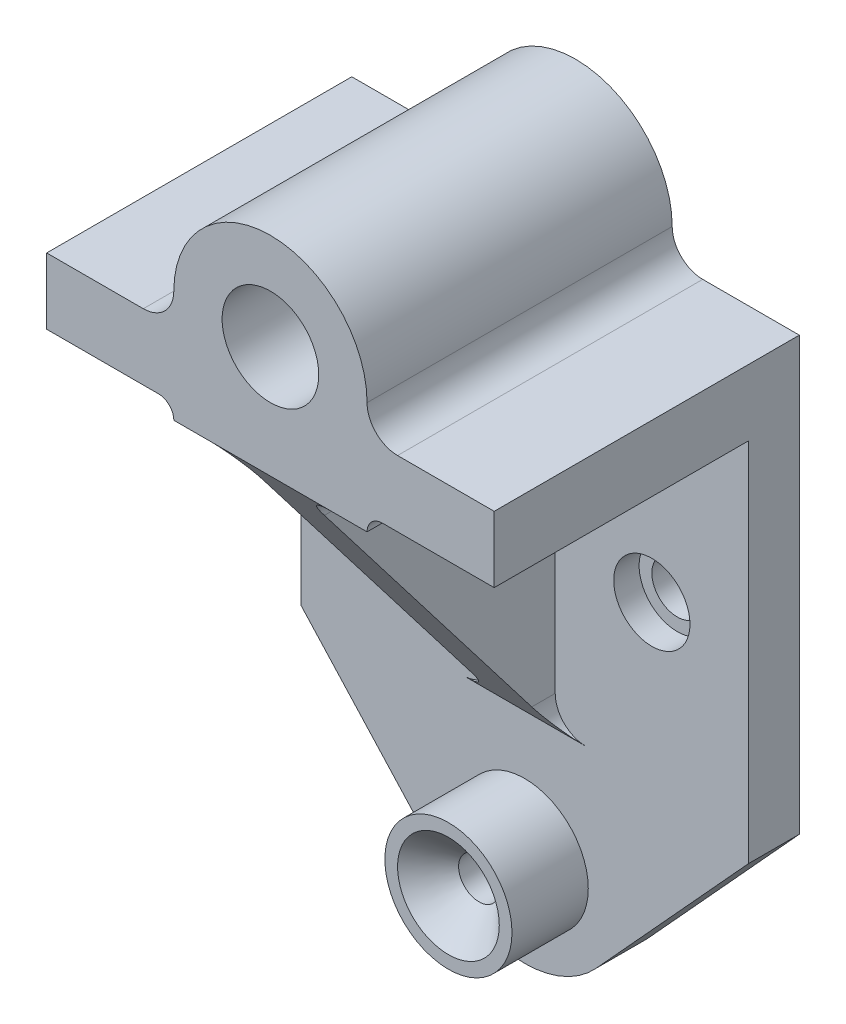
ISO-10303-21;
HEADER;
FILE_DESCRIPTION(('STEP AP214'),'2;1');
FILE_NAME('part.step','',(''),(''),'','','');
FILE_SCHEMA(('AUTOMOTIVE_DESIGN { 1 0 10303 214 1 1 1 1 }'));
ENDSEC;
DATA;
#1=APPLICATION_CONTEXT('core data for automotive mechanical design processes');
#2=APPLICATION_PROTOCOL_DEFINITION('international standard','automotive_design',2000,#1);
#3=PRODUCT_CONTEXT('',#1,'mechanical');
#4=PRODUCT('Part','Part','',(#3));
#5=PRODUCT_RELATED_PRODUCT_CATEGORY('part','',(#4));
#6=PRODUCT_DEFINITION_FORMATION('','',#4);
#7=PRODUCT_DEFINITION_CONTEXT('part definition',#1,'design');
#8=PRODUCT_DEFINITION('design','',#6,#7);
#9=PRODUCT_DEFINITION_SHAPE('','',#8);
#10=(LENGTH_UNIT() NAMED_UNIT(*) SI_UNIT(.MILLI.,.METRE.));
#11=(NAMED_UNIT(*) PLANE_ANGLE_UNIT() SI_UNIT($,.RADIAN.));
#12=(NAMED_UNIT(*) SI_UNIT($,.STERADIAN.) SOLID_ANGLE_UNIT());
#13=UNCERTAINTY_MEASURE_WITH_UNIT(LENGTH_MEASURE(1.E-05),#10,'distance_accuracy_value','');
#14=(GEOMETRIC_REPRESENTATION_CONTEXT(3) GLOBAL_UNCERTAINTY_ASSIGNED_CONTEXT((#13)) GLOBAL_UNIT_ASSIGNED_CONTEXT((#10,
#11,#12)) REPRESENTATION_CONTEXT('',''));
#15=CARTESIAN_POINT('',(0.,0.,0.));
#16=DIRECTION('',(0.,0.,1.));
#17=DIRECTION('',(1.,0.,0.));
#18=AXIS2_PLACEMENT_3D('',#15,#16,#17);
#19=CARTESIAN_POINT('',(-25.,111.,60.));
#20=DIRECTION('',(0.,0.,1.));
#21=DIRECTION('',(1.,0.,0.));
#22=AXIS2_PLACEMENT_3D('',#19,#20,#21);
#23=PLANE('',#22);
#24=DIRECTION('',(1.,0.,0.));
#25=VECTOR('',#24,1.);
#26=CARTESIAN_POINT('',(-19.,89.,60.));
#27=LINE('',#26,#25);
#28=CARTESIAN_POINT('',(-12.,89.,60.));
#29=VERTEX_POINT('',#28);
#30=CARTESIAN_POINT('',(12.,89.,60.));
#31=VERTEX_POINT('',#30);
#32=EDGE_CURVE('E365',#29,#31,#27,.T.);
#33=ORIENTED_EDGE('',*,*,#32,.T.);
#34=DIRECTION('',(1.,0.,0.));
#35=VECTOR('',#34,1.);
#36=CARTESIAN_POINT('',(-25.,89.,60.));
#37=LINE('',#36,#35);
#38=CARTESIAN_POINT('',(19.,89.,60.));
#39=VERTEX_POINT('',#38);
#40=EDGE_CURVE('E325',#31,#39,#37,.T.);
#41=ORIENTED_EDGE('',*,*,#40,.T.);
#42=CARTESIAN_POINT('',(22.,89.,60.));
#43=DIRECTION('',(0.,0.,1.));
#44=DIRECTION('',(1.,0.,0.));
#45=AXIS2_PLACEMENT_3D('',#42,#43,#44);
#46=CIRCLE('',#45,3.);
#47=CARTESIAN_POINT('',(22.,92.,60.));
#48=VERTEX_POINT('',#47);
#49=EDGE_CURVE('E43',#48,#39,#46,.T.);
#50=ORIENTED_EDGE('',*,*,#49,.F.);
#51=DIRECTION('',(1.,0.,0.));
#52=VECTOR('',#51,1.);
#53=CARTESIAN_POINT('',(-25.,92.,60.));
#54=LINE('',#53,#52);
#55=CARTESIAN_POINT('',(44.,92.,60.));
#56=VERTEX_POINT('',#55);
#57=EDGE_CURVE('E48',#48,#56,#54,.T.);
#58=ORIENTED_EDGE('',*,*,#57,.T.);
#59=DIRECTION('',(0.,1.,0.));
#60=VECTOR('',#59,1.);
#61=CARTESIAN_POINT('',(44.,20.,60.));
#62=LINE('',#61,#60);
#63=CARTESIAN_POINT('',(44.,105.,60.));
#64=VERTEX_POINT('',#63);
#65=EDGE_CURVE('E293',#56,#64,#62,.T.);
#66=ORIENTED_EDGE('',*,*,#65,.T.);
#67=DIRECTION('',(-1.,0.,0.));
#68=VECTOR('',#67,1.);
#69=CARTESIAN_POINT('',(44.,105.,60.));
#70=LINE('',#69,#68);
#71=CARTESIAN_POINT('',(25.,105.,60.));
#72=VERTEX_POINT('',#71);
#73=EDGE_CURVE('E291',#64,#72,#70,.T.);
#74=ORIENTED_EDGE('',*,*,#73,.T.);
#75=CARTESIAN_POINT('',(25.,111.,60.));
#76=DIRECTION('',(0.,0.,-1.));
#77=DIRECTION('',(-1.,0.,0.));
#78=AXIS2_PLACEMENT_3D('',#75,#76,#77);
#79=CIRCLE('',#78,6.00000000000001);
#80=CARTESIAN_POINT('',(19.,111.,60.));
#81=VERTEX_POINT('',#80);
#82=EDGE_CURVE('E289',#72,#81,#79,.T.);
#83=ORIENTED_EDGE('',*,*,#82,.T.);
#84=CARTESIAN_POINT('',(0.,111.,60.));
#85=DIRECTION('',(0.,0.,1.));
#86=DIRECTION('',(1.,0.,0.));
#87=AXIS2_PLACEMENT_3D('',#84,#85,#86);
#88=CIRCLE('',#87,19.);
#89=CARTESIAN_POINT('',(-19.,111.,60.));
#90=VERTEX_POINT('',#89);
#91=EDGE_CURVE('E287',#81,#90,#88,.T.);
#92=ORIENTED_EDGE('',*,*,#91,.T.);
#93=CARTESIAN_POINT('',(-25.,111.,60.));
#94=DIRECTION('',(0.,0.,1.));
#95=DIRECTION('',(1.,0.,0.));
#96=AXIS2_PLACEMENT_3D('',#93,#94,#95);
#97=CIRCLE('',#96,6.00000000000001);
#98=CARTESIAN_POINT('',(-25.,105.,60.));
#99=VERTEX_POINT('',#98);
#100=EDGE_CURVE('E283',#99,#90,#97,.T.);
#101=ORIENTED_EDGE('',*,*,#100,.F.);
#102=DIRECTION('',(1.,0.,0.));
#103=VECTOR('',#102,1.);
#104=CARTESIAN_POINT('',(-44.,105.,60.));
#105=LINE('',#104,#103);
#106=CARTESIAN_POINT('',(-44.,105.,60.));
#107=VERTEX_POINT('',#106);
#108=EDGE_CURVE('E280',#107,#99,#105,.T.);
#109=ORIENTED_EDGE('',*,*,#108,.F.);
#110=DIRECTION('',(0.,1.,0.));
#111=VECTOR('',#110,1.);
#112=CARTESIAN_POINT('',(-44.,20.,60.));
#113=LINE('',#112,#111);
#114=CARTESIAN_POINT('',(-44.,92.,60.));
#115=VERTEX_POINT('',#114);
#116=EDGE_CURVE('E295',#115,#107,#113,.T.);
#117=ORIENTED_EDGE('',*,*,#116,.F.);
#118=DIRECTION('',(-1.,0.,0.));
#119=VECTOR('',#118,1.);
#120=CARTESIAN_POINT('',(-25.,92.,60.));
#121=LINE('',#120,#119);
#122=CARTESIAN_POINT('',(-22.,92.,60.));
#123=VERTEX_POINT('',#122);
#124=EDGE_CURVE('E12',#123,#115,#121,.T.);
#125=ORIENTED_EDGE('',*,*,#124,.F.);
#126=CARTESIAN_POINT('',(-22.,89.,60.));
#127=DIRECTION('',(0.,0.,1.));
#128=DIRECTION('',(1.,0.,0.));
#129=AXIS2_PLACEMENT_3D('',#126,#127,#128);
#130=CIRCLE('',#129,3.);
#131=CARTESIAN_POINT('',(-19.,89.,60.));
#132=VERTEX_POINT('',#131);
#133=EDGE_CURVE('E350',#132,#123,#130,.T.);
#134=ORIENTED_EDGE('',*,*,#133,.F.);
#135=EDGE_CURVE('E348',#132,#29,#37,.T.);
#136=ORIENTED_EDGE('',*,*,#135,.T.);
#137=EDGE_LOOP('',(#33,#41,#50,#58,#66,#74,#83,#92,#101,#109,#117,#125,#134,#136));
#138=FACE_BOUND('',#137,.T.);
#139=CARTESIAN_POINT('',(0.,111.,60.));
#140=DIRECTION('',(0.,0.,1.));
#141=DIRECTION('',(1.,0.,0.));
#142=AXIS2_PLACEMENT_3D('',#139,#140,#141);
#143=CIRCLE('',#142,9.50000000000001);
#144=CARTESIAN_POINT('',(9.50000000000001,111.,60.));
#145=VERTEX_POINT('',#144);
#146=EDGE_CURVE('E388',#145,#145,#143,.T.);
#147=ORIENTED_EDGE('',*,*,#146,.F.);
#148=EDGE_LOOP('',(#147));
#149=FACE_BOUND('',#148,.T.);
#150=ADVANCED_FACE('F39',(#138,#149),#23,.T.);
#151=CARTESIAN_POINT('',(-12.,83.,9.99999999999999));
#152=DIRECTION('',(0.,0.,1.));
#153=DIRECTION('',(1.,0.,0.));
#154=AXIS2_PLACEMENT_3D('',#151,#152,#153);
#155=CYLINDRICAL_SURFACE('',#154,5.99999999999999);
#156=DIRECTION('',(0.,0.,1.));
#157=VECTOR('',#156,1.);
#158=CARTESIAN_POINT('',(-6.00000000000001,83.,9.99999999999999));
#159=LINE('',#158,#157);
#160=CARTESIAN_POINT('',(-6.00000000000001,83.,9.99999999999999));
#161=VERTEX_POINT('',#160);
#162=CARTESIAN_POINT('',(-6.00000000000001,83.,55.3846153846154));
#163=VERTEX_POINT('',#162);
#164=EDGE_CURVE('E221',#161,#163,#159,.T.);
#165=ORIENTED_EDGE('',*,*,#164,.T.);
#166=CARTESIAN_POINT('',(-12.,83.,55.3846153846154));
#167=DIRECTION('',(0.,0.609710760849693,-0.7926239891046));
#168=DIRECTION('',(0.,0.7926239891046,0.609710760849693));
#169=AXIS2_PLACEMENT_3D('',#166,#167,#168);
#170=ELLIPSE('',#169,7.56979360008771,5.99999999999999);
#171=EDGE_CURVE('E212',#163,#29,#170,.F.);
#172=ORIENTED_EDGE('',*,*,#171,.T.);
#173=DIRECTION('',(0.,0.,1.));
#174=VECTOR('',#173,1.);
#175=CARTESIAN_POINT('',(-12.,89.,9.99999999999999));
#176=LINE('',#175,#174);
#177=CARTESIAN_POINT('',(-12.,89.,9.99999999999999));
#178=VERTEX_POINT('',#177);
#179=EDGE_CURVE('E222',#178,#29,#176,.T.);
#180=ORIENTED_EDGE('',*,*,#179,.F.);
#181=CARTESIAN_POINT('',(-12.,83.,9.99999999999999));
#182=DIRECTION('',(0.,0.,1.));
#183=DIRECTION('',(1.,0.,0.));
#184=AXIS2_PLACEMENT_3D('',#181,#182,#183);
#185=CIRCLE('',#184,5.99999999999999);
#186=EDGE_CURVE('E420',#161,#178,#185,.T.);
#187=ORIENTED_EDGE('',*,*,#186,.F.);
#188=EDGE_LOOP('',(#165,#172,#180,#187));
#189=FACE_BOUND('',#188,.T.);
#190=ADVANCED_FACE('F436',(#189),#155,.F.);
#191=CARTESIAN_POINT('',(12.,83.,9.99999999999999));
#192=DIRECTION('',(0.,0.,1.));
#193=DIRECTION('',(1.,0.,0.));
#194=AXIS2_PLACEMENT_3D('',#191,#192,#193);
#195=CYLINDRICAL_SURFACE('',#194,5.99999999999999);
#196=DIRECTION('',(0.,0.,1.));
#197=VECTOR('',#196,1.);
#198=CARTESIAN_POINT('',(12.,89.,9.99999999999999));
#199=LINE('',#198,#197);
#200=CARTESIAN_POINT('',(12.,88.9999999999999,9.99999999999999));
#201=VERTEX_POINT('',#200);
#202=EDGE_CURVE('E226',#201,#31,#199,.T.);
#203=ORIENTED_EDGE('',*,*,#202,.T.);
#204=CARTESIAN_POINT('',(12.,83.,55.3846153846154));
#205=DIRECTION('',(0.,0.609710760849693,-0.7926239891046));
#206=DIRECTION('',(0.,0.7926239891046,0.609710760849693));
#207=AXIS2_PLACEMENT_3D('',#204,#205,#206);
#208=ELLIPSE('',#207,7.56979360008771,5.99999999999999);
#209=CARTESIAN_POINT('',(6.00000000000001,83.,55.3846153846154));
#210=VERTEX_POINT('',#209);
#211=EDGE_CURVE('E371',#31,#210,#208,.F.);
#212=ORIENTED_EDGE('',*,*,#211,.T.);
#213=DIRECTION('',(0.,0.,1.));
#214=VECTOR('',#213,1.);
#215=CARTESIAN_POINT('',(6.00000000000001,83.,9.99999999999999));
#216=LINE('',#215,#214);
#217=CARTESIAN_POINT('',(6.00000000000001,83.,9.99999999999999));
#218=VERTEX_POINT('',#217);
#219=EDGE_CURVE('E229',#218,#210,#216,.T.);
#220=ORIENTED_EDGE('',*,*,#219,.F.);
#221=CARTESIAN_POINT('',(12.,83.,9.99999999999999));
#222=DIRECTION('',(0.,0.,1.));
#223=DIRECTION('',(1.,0.,0.));
#224=AXIS2_PLACEMENT_3D('',#221,#222,#223);
#225=CIRCLE('',#224,5.99999999999999);
#226=EDGE_CURVE('E56',#201,#218,#225,.T.);
#227=ORIENTED_EDGE('',*,*,#226,.F.);
#228=EDGE_LOOP('',(#203,#212,#220,#227));
#229=FACE_BOUND('',#228,.T.);
#230=ADVANCED_FACE('F369',(#229),#195,.F.);
#231=CARTESIAN_POINT('',(6.00000000000001,0.,9.99999999999999));
#232=DIRECTION('',(-1.,0.,0.));
#233=DIRECTION('',(0.,-1.,0.));
#234=AXIS2_PLACEMENT_3D('',#231,#232,#233);
#235=PLANE('',#234);
#236=ORIENTED_EDGE('',*,*,#219,.T.);
#237=DIRECTION('',(0.,-0.7926239891046,-0.609710760849693));
#238=VECTOR('',#237,1.);
#239=CARTESIAN_POINT('',(6.00000000000001,8.92193308550186,-1.59851301115243));
#240=LINE('',#239,#238);
#241=CARTESIAN_POINT('',(6.00000000000001,30.,14.6153846153846));
#242=VERTEX_POINT('',#241);
#243=EDGE_CURVE('E211',#210,#242,#240,.T.);
#244=ORIENTED_EDGE('',*,*,#243,.T.);
#245=DIRECTION('',(0.,0.,1.));
#246=VECTOR('',#245,1.);
#247=CARTESIAN_POINT('',(6.00000000000001,30.,9.99999999999999));
#248=LINE('',#247,#246);
#249=CARTESIAN_POINT('',(6.00000000000001,30.,9.99999999999999));
#250=VERTEX_POINT('',#249);
#251=EDGE_CURVE('E210',#250,#242,#248,.T.);
#252=ORIENTED_EDGE('',*,*,#251,.F.);
#253=DIRECTION('',(0.,-1.,0.));
#254=VECTOR('',#253,1.);
#255=CARTESIAN_POINT('',(6.00000000000001,0.,9.99999999999999));
#256=LINE('',#255,#254);
#257=EDGE_CURVE('E61',#218,#250,#256,.T.);
#258=ORIENTED_EDGE('',*,*,#257,.F.);
#259=EDGE_LOOP('',(#236,#244,#252,#258));
#260=FACE_BOUND('',#259,.T.);
#261=ADVANCED_FACE('F373',(#260),#235,.F.);
#262=CARTESIAN_POINT('',(12.,30.,9.99999999999999));
#263=DIRECTION('',(0.,0.,1.));
#264=DIRECTION('',(1.,0.,0.));
#265=AXIS2_PLACEMENT_3D('',#262,#263,#264);
#266=CYLINDRICAL_SURFACE('',#265,6.);
#267=ORIENTED_EDGE('',*,*,#251,.T.);
#268=CARTESIAN_POINT('',(12.,30.,14.6153846153846));
#269=DIRECTION('',(0.,0.609710760849693,-0.7926239891046));
#270=DIRECTION('',(0.,0.7926239891046,0.609710760849693));
#271=AXIS2_PLACEMENT_3D('',#268,#269,#270);
#272=ELLIPSE('',#271,7.56979360008772,6.);
#273=CARTESIAN_POINT('',(12.,24.,9.99999999999999));
#274=VERTEX_POINT('',#273);
#275=EDGE_CURVE('E198',#242,#274,#272,.F.);
#276=ORIENTED_EDGE('',*,*,#275,.T.);
#277=CARTESIAN_POINT('',(12.,30.,9.99999999999999));
#278=DIRECTION('',(0.,0.,1.));
#279=DIRECTION('',(1.,0.,0.));
#280=AXIS2_PLACEMENT_3D('',#277,#278,#279);
#281=CIRCLE('',#280,6.);
#282=EDGE_CURVE('E203',#250,#274,#281,.T.);
#283=ORIENTED_EDGE('',*,*,#282,.F.);
#284=EDGE_LOOP('',(#267,#276,#283));
#285=FACE_BOUND('',#284,.T.);
#286=ADVANCED_FACE('F209',(#285),#266,.F.);
#287=CARTESIAN_POINT('',(-12.,30.,9.99999999999999));
#288=DIRECTION('',(0.,0.,1.));
#289=DIRECTION('',(1.,0.,0.));
#290=AXIS2_PLACEMENT_3D('',#287,#288,#289);
#291=CYLINDRICAL_SURFACE('',#290,6.);
#292=CARTESIAN_POINT('',(-12.,30.,9.99999999999999));
#293=DIRECTION('',(0.,0.,1.));
#294=DIRECTION('',(1.,0.,0.));
#295=AXIS2_PLACEMENT_3D('',#292,#293,#294);
#296=CIRCLE('',#295,6.);
#297=CARTESIAN_POINT('',(-12.,24.,9.99999999999999));
#298=VERTEX_POINT('',#297);
#299=CARTESIAN_POINT('',(-6.00000000000001,30.,9.99999999999999));
#300=VERTEX_POINT('',#299);
#301=EDGE_CURVE('E204',#298,#300,#296,.T.);
#302=ORIENTED_EDGE('',*,*,#301,.F.);
#303=CARTESIAN_POINT('',(-12.,30.,14.6153846153846));
#304=DIRECTION('',(0.,0.609710760849693,-0.7926239891046));
#305=DIRECTION('',(0.,0.7926239891046,0.609710760849693));
#306=AXIS2_PLACEMENT_3D('',#303,#304,#305);
#307=ELLIPSE('',#306,7.56979360008772,6.);
#308=CARTESIAN_POINT('',(-6.00000000000001,30.,14.6153846153846));
#309=VERTEX_POINT('',#308);
#310=EDGE_CURVE('E201',#298,#309,#307,.F.);
#311=ORIENTED_EDGE('',*,*,#310,.T.);
#312=DIRECTION('',(0.,0.,1.));
#313=VECTOR('',#312,1.);
#314=CARTESIAN_POINT('',(-6.00000000000001,30.,9.99999999999999));
#315=LINE('',#314,#313);
#316=EDGE_CURVE('E233',#300,#309,#315,.T.);
#317=ORIENTED_EDGE('',*,*,#316,.F.);
#318=EDGE_LOOP('',(#302,#311,#317));
#319=FACE_BOUND('',#318,.T.);
#320=ADVANCED_FACE('F427',(#319),#291,.F.);
#321=CARTESIAN_POINT('',(-6.00000000000001,0.,9.99999999999999));
#322=DIRECTION('',(-1.,0.,0.));
#323=DIRECTION('',(0.,-1.,0.));
#324=AXIS2_PLACEMENT_3D('',#321,#322,#323);
#325=PLANE('',#324);
#326=DIRECTION('',(0.,-0.7926239891046,-0.609710760849693));
#327=VECTOR('',#326,1.);
#328=CARTESIAN_POINT('',(-6.00000000000001,8.92193308550186,-1.59851301115243));
#329=LINE('',#328,#327);
#330=EDGE_CURVE('E432',#163,#309,#329,.T.);
#331=ORIENTED_EDGE('',*,*,#330,.F.);
#332=ORIENTED_EDGE('',*,*,#164,.F.);
#333=DIRECTION('',(0.,-1.,0.));
#334=VECTOR('',#333,1.);
#335=CARTESIAN_POINT('',(-6.00000000000001,0.,9.99999999999999));
#336=LINE('',#335,#334);
#337=EDGE_CURVE('E422',#161,#300,#336,.T.);
#338=ORIENTED_EDGE('',*,*,#337,.T.);
#339=ORIENTED_EDGE('',*,*,#316,.T.);
#340=EDGE_LOOP('',(#331,#332,#338,#339));
#341=FACE_BOUND('',#340,.T.);
#342=ADVANCED_FACE('F430',(#341),#325,.T.);
#343=CARTESIAN_POINT('',(1.76446159270784E-13,89.,9.99999999999999));
#344=DIRECTION('',(0.,-1.,0.));
#345=DIRECTION('',(1.,0.,0.));
#346=AXIS2_PLACEMENT_3D('',#343,#344,#345);
#347=PLANE('',#346);
#348=DIRECTION('',(1.,0.,0.));
#349=VECTOR('',#348,1.);
#350=CARTESIAN_POINT('',(1.76446159270784E-13,89.,9.99999999999999));
#351=LINE('',#350,#349);
#352=CARTESIAN_POINT('',(-19.,89.,9.99999999999999));
#353=VERTEX_POINT('',#352);
#354=EDGE_CURVE('E241',#353,#178,#351,.T.);
#355=ORIENTED_EDGE('',*,*,#354,.T.);
#356=ORIENTED_EDGE('',*,*,#179,.T.);
#357=ORIENTED_EDGE('',*,*,#135,.F.);
#358=DIRECTION('',(0.,0.,1.));
#359=VECTOR('',#358,1.);
#360=CARTESIAN_POINT('',(-19.,89.,9.99999999999999));
#361=LINE('',#360,#359);
#362=EDGE_CURVE('E263',#353,#132,#361,.T.);
#363=ORIENTED_EDGE('',*,*,#362,.F.);
#364=EDGE_LOOP('',(#355,#356,#357,#363));
#365=FACE_BOUND('',#364,.T.);
#366=ADVANCED_FACE('F440',(#365),#347,.T.);
#367=CARTESIAN_POINT('',(0.,0.,9.99999999999999));
#368=DIRECTION('',(0.,0.,1.));
#369=DIRECTION('',(1.,0.,0.));
#370=AXIS2_PLACEMENT_3D('',#367,#368,#369);
#371=PLANE('',#370);
#372=ORIENTED_EDGE('',*,*,#282,.T.);
#373=DIRECTION('',(1.,0.,0.));
#374=VECTOR('',#373,1.);
#375=CARTESIAN_POINT('',(0.,24.,9.99999999999999));
#376=LINE('',#375,#374);
#377=EDGE_CURVE('E195',#298,#274,#376,.T.);
#378=ORIENTED_EDGE('',*,*,#377,.F.);
#379=ORIENTED_EDGE('',*,*,#301,.T.);
#380=ORIENTED_EDGE('',*,*,#337,.F.);
#381=ORIENTED_EDGE('',*,*,#186,.T.);
#382=ORIENTED_EDGE('',*,*,#354,.F.);
#383=CARTESIAN_POINT('',(-22.,89.,9.99999999999999));
#384=DIRECTION('',(0.,0.,1.));
#385=DIRECTION('',(1.,0.,0.));
#386=AXIS2_PLACEMENT_3D('',#383,#384,#385);
#387=CIRCLE('',#386,3.);
#388=CARTESIAN_POINT('',(-22.,92.,9.99999999999999));
#389=VERTEX_POINT('',#388);
#390=EDGE_CURVE('E244',#353,#389,#387,.T.);
#391=ORIENTED_EDGE('',*,*,#390,.T.);
#392=DIRECTION('',(1.,0.,0.));
#393=VECTOR('',#392,1.);
#394=CARTESIAN_POINT('',(0.,92.,9.99999999999999));
#395=LINE('',#394,#393);
#396=CARTESIAN_POINT('',(-44.,92.,9.99999999999999));
#397=VERTEX_POINT('',#396);
#398=EDGE_CURVE('E247',#397,#389,#395,.T.);
#399=ORIENTED_EDGE('',*,*,#398,.F.);
#400=DIRECTION('',(0.,-1.,0.));
#401=VECTOR('',#400,1.);
#402=CARTESIAN_POINT('',(-44.,0.,9.99999999999999));
#403=LINE('',#402,#401);
#404=CARTESIAN_POINT('',(-44.,20.,9.99999999999999));
#405=VERTEX_POINT('',#404);
#406=EDGE_CURVE('E249',#397,#405,#403,.T.);
#407=ORIENTED_EDGE('',*,*,#406,.T.);
#408=DIRECTION('',(0.674401871493762,-0.73836448704262,0.));
#409=VECTOR('',#408,1.);
#410=CARTESIAN_POINT('',(-14.0289252538098,-12.8136355583815,9.99999999999999));
#411=LINE('',#410,#409);
#412=CARTESIAN_POINT('',(-14.0289252538098,-12.8136355583815,9.99999999999999));
#413=VERTEX_POINT('',#412);
#414=EDGE_CURVE('E251',#405,#413,#411,.T.);
#415=ORIENTED_EDGE('',*,*,#414,.T.);
#416=CARTESIAN_POINT('',(0.,0.,9.99999999999999));
#417=DIRECTION('',(0.,0.,1.));
#418=DIRECTION('',(1.,0.,0.));
#419=AXIS2_PLACEMENT_3D('',#416,#417,#418);
#420=CIRCLE('',#419,19.);
#421=CARTESIAN_POINT('',(14.0289252538098,-12.8136355583815,9.99999999999999));
#422=VERTEX_POINT('',#421);
#423=EDGE_CURVE('E253',#413,#422,#420,.T.);
#424=ORIENTED_EDGE('',*,*,#423,.T.);
#425=DIRECTION('',(0.674401871493762,0.73836448704262,0.));
#426=VECTOR('',#425,1.);
#427=CARTESIAN_POINT('',(14.0289252538098,-12.8136355583815,9.99999999999999));
#428=LINE('',#427,#426);
#429=CARTESIAN_POINT('',(44.,20.,9.99999999999999));
#430=VERTEX_POINT('',#429);
#431=EDGE_CURVE('E255',#422,#430,#428,.T.);
#432=ORIENTED_EDGE('',*,*,#431,.T.);
#433=DIRECTION('',(0.,1.,0.));
#434=VECTOR('',#433,1.);
#435=CARTESIAN_POINT('',(44.,0.,9.99999999999999));
#436=LINE('',#435,#434);
#437=CARTESIAN_POINT('',(44.,92.,9.99999999999999));
#438=VERTEX_POINT('',#437);
#439=EDGE_CURVE('E257',#430,#438,#436,.T.);
#440=ORIENTED_EDGE('',*,*,#439,.T.);
#441=DIRECTION('',(-1.,0.,0.));
#442=VECTOR('',#441,1.);
#443=CARTESIAN_POINT('',(0.,92.,9.99999999999999));
#444=LINE('',#443,#442);
#445=CARTESIAN_POINT('',(22.,92.,9.99999999999999));
#446=VERTEX_POINT('',#445);
#447=EDGE_CURVE('E259',#438,#446,#444,.T.);
#448=ORIENTED_EDGE('',*,*,#447,.T.);
#449=CARTESIAN_POINT('',(22.,89.,9.99999999999999));
#450=DIRECTION('',(0.,0.,1.));
#451=DIRECTION('',(1.,0.,0.));
#452=AXIS2_PLACEMENT_3D('',#449,#450,#451);
#453=CIRCLE('',#452,3.);
#454=CARTESIAN_POINT('',(19.,89.,9.99999999999999));
#455=VERTEX_POINT('',#454);
#456=EDGE_CURVE('E225',#446,#455,#453,.T.);
#457=ORIENTED_EDGE('',*,*,#456,.T.);
#458=EDGE_CURVE('E240',#201,#455,#351,.T.);
#459=ORIENTED_EDGE('',*,*,#458,.F.);
#460=ORIENTED_EDGE('',*,*,#226,.T.);
#461=ORIENTED_EDGE('',*,*,#257,.T.);
#462=EDGE_LOOP('',(#372,#378,#379,#380,#381,#382,#391,#399,#407,#415,#424,#432,#440,#448,#457,
#459,#460,#461));
#463=FACE_BOUND('',#462,.T.);
#464=CARTESIAN_POINT('',(0.,0.,9.99999999999999));
#465=DIRECTION('',(0.,0.,1.));
#466=DIRECTION('',(1.,0.,0.));
#467=AXIS2_PLACEMENT_3D('',#464,#465,#466);
#468=CIRCLE('',#467,12.5);
#469=CARTESIAN_POINT('',(12.5,0.,9.99999999999999));
#470=VERTEX_POINT('',#469);
#471=EDGE_CURVE('E382',#470,#470,#468,.T.);
#472=ORIENTED_EDGE('',*,*,#471,.F.);
#473=EDGE_LOOP('',(#472));
#474=FACE_BOUND('',#473,.T.);
#475=CARTESIAN_POINT('',(-25.,55.,9.99999999999999));
#476=DIRECTION('',(0.,0.,1.));
#477=DIRECTION('',(1.,0.,0.));
#478=AXIS2_PLACEMENT_3D('',#475,#476,#477);
#479=CIRCLE('',#478,7.5);
#480=CARTESIAN_POINT('',(-17.5,55.,9.99999999999999));
#481=VERTEX_POINT('',#480);
#482=EDGE_CURVE('E394',#481,#481,#479,.T.);
#483=ORIENTED_EDGE('',*,*,#482,.F.);
#484=EDGE_LOOP('',(#483));
#485=FACE_BOUND('',#484,.T.);
#486=CARTESIAN_POINT('',(25.,55.,9.99999999999999));
#487=DIRECTION('',(0.,0.,1.));
#488=DIRECTION('',(1.,0.,0.));
#489=AXIS2_PLACEMENT_3D('',#486,#487,#488);
#490=CIRCLE('',#489,7.5);
#491=CARTESIAN_POINT('',(32.5,55.,9.99999999999999));
#492=VERTEX_POINT('',#491);
#493=EDGE_CURVE('E408',#492,#492,#490,.T.);
#494=ORIENTED_EDGE('',*,*,#493,.F.);
#495=EDGE_LOOP('',(#494));
#496=FACE_BOUND('',#495,.T.);
#497=ADVANCED_FACE('F214',(#463,#474,#485,#496),#371,.T.);
#498=CARTESIAN_POINT('',(-44.,20.,60.));
#499=DIRECTION('',(0.73836448704262,0.674401871493762,0.));
#500=DIRECTION('',(-0.674401871493762,0.73836448704262,0.));
#501=AXIS2_PLACEMENT_3D('',#498,#499,#500);
#502=PLANE('',#501);
#503=ORIENTED_EDGE('',*,*,#414,.F.);
#504=DIRECTION('',(0.,0.,-1.));
#505=VECTOR('',#504,1.);
#506=CARTESIAN_POINT('',(-44.,20.,60.));
#507=LINE('',#506,#505);
#508=CARTESIAN_POINT('',(-44.,20.,0.));
#509=VERTEX_POINT('',#508);
#510=EDGE_CURVE('E326',#405,#509,#507,.T.);
#511=ORIENTED_EDGE('',*,*,#510,.T.);
#512=DIRECTION('',(0.674401871493762,-0.73836448704262,0.));
#513=VECTOR('',#512,1.);
#514=CARTESIAN_POINT('',(-44.,20.,0.));
#515=LINE('',#514,#513);
#516=CARTESIAN_POINT('',(-14.0289252538098,-12.8136355583815,0.));
#517=VERTEX_POINT('',#516);
#518=EDGE_CURVE('E318',#509,#517,#515,.T.);
#519=ORIENTED_EDGE('',*,*,#518,.T.);
#520=DIRECTION('',(0.,0.,-1.));
#521=VECTOR('',#520,1.);
#522=CARTESIAN_POINT('',(-14.0289252538098,-12.8136355583815,60.));
#523=LINE('',#522,#521);
#524=EDGE_CURVE('E328',#413,#517,#523,.T.);
#525=ORIENTED_EDGE('',*,*,#524,.F.);
#526=EDGE_LOOP('',(#503,#511,#519,#525));
#527=FACE_BOUND('',#526,.T.);
#528=ADVANCED_FACE('F459',(#527),#502,.F.);
#529=CARTESIAN_POINT('',(0.,0.,60.));
#530=DIRECTION('',(0.,0.,-1.));
#531=DIRECTION('',(-1.,0.,0.));
#532=AXIS2_PLACEMENT_3D('',#529,#530,#531);
#533=CYLINDRICAL_SURFACE('',#532,19.);
#534=ORIENTED_EDGE('',*,*,#423,.F.);
#535=ORIENTED_EDGE('',*,*,#524,.T.);
#536=CARTESIAN_POINT('',(0.,0.,0.));
#537=DIRECTION('',(0.,0.,1.));
#538=DIRECTION('',(1.,0.,0.));
#539=AXIS2_PLACEMENT_3D('',#536,#537,#538);
#540=CIRCLE('',#539,19.);
#541=CARTESIAN_POINT('',(14.0289252538098,-12.8136355583815,0.));
#542=VERTEX_POINT('',#541);
#543=EDGE_CURVE('E315',#517,#542,#540,.T.);
#544=ORIENTED_EDGE('',*,*,#543,.T.);
#545=DIRECTION('',(0.,0.,-1.));
#546=VECTOR('',#545,1.);
#547=CARTESIAN_POINT('',(14.0289252538098,-12.8136355583815,60.));
#548=LINE('',#547,#546);
#549=EDGE_CURVE('E330',#422,#542,#548,.T.);
#550=ORIENTED_EDGE('',*,*,#549,.F.);
#551=EDGE_LOOP('',(#534,#535,#544,#550));
#552=FACE_BOUND('',#551,.T.);
#553=ADVANCED_FACE('F463',(#552),#533,.T.);
#554=CARTESIAN_POINT('',(44.,20.,60.));
#555=DIRECTION('',(0.73836448704262,-0.674401871493762,0.));
#556=DIRECTION('',(0.674401871493762,0.73836448704262,0.));
#557=AXIS2_PLACEMENT_3D('',#554,#555,#556);
#558=PLANE('',#557);
#559=DIRECTION('',(0.,0.,-1.));
#560=VECTOR('',#559,1.);
#561=CARTESIAN_POINT('',(44.,20.,60.));
#562=LINE('',#561,#560);
#563=CARTESIAN_POINT('',(44.,20.,0.));
#564=VERTEX_POINT('',#563);
#565=EDGE_CURVE('E332',#430,#564,#562,.T.);
#566=ORIENTED_EDGE('',*,*,#565,.F.);
#567=ORIENTED_EDGE('',*,*,#431,.F.);
#568=ORIENTED_EDGE('',*,*,#549,.T.);
#569=DIRECTION('',(-0.674401871493762,-0.73836448704262,0.));
#570=VECTOR('',#569,1.);
#571=CARTESIAN_POINT('',(44.,20.,0.));
#572=LINE('',#571,#570);
#573=EDGE_CURVE('E312',#564,#542,#572,.T.);
#574=ORIENTED_EDGE('',*,*,#573,.F.);
#575=EDGE_LOOP('',(#566,#567,#568,#574));
#576=FACE_BOUND('',#575,.T.);
#577=ADVANCED_FACE('F469',(#576),#558,.T.);
#578=CARTESIAN_POINT('',(44.,20.,60.));
#579=DIRECTION('',(-1.,0.,0.));
#580=DIRECTION('',(0.,-1.,0.));
#581=AXIS2_PLACEMENT_3D('',#578,#579,#580);
#582=PLANE('',#581);
#583=DIRECTION('',(0.,0.,-1.));
#584=VECTOR('',#583,1.);
#585=CARTESIAN_POINT('',(44.,92.,60.000012));
#586=LINE('',#585,#584);
#587=EDGE_CURVE('E272',#56,#438,#586,.T.);
#588=ORIENTED_EDGE('',*,*,#587,.T.);
#589=ORIENTED_EDGE('',*,*,#439,.F.);
#590=ORIENTED_EDGE('',*,*,#565,.T.);
#591=DIRECTION('',(0.,1.,0.));
#592=VECTOR('',#591,1.);
#593=CARTESIAN_POINT('',(44.,20.,0.));
#594=LINE('',#593,#592);
#595=CARTESIAN_POINT('',(44.,105.,0.));
#596=VERTEX_POINT('',#595);
#597=EDGE_CURVE('E310',#564,#596,#594,.T.);
#598=ORIENTED_EDGE('',*,*,#597,.T.);
#599=DIRECTION('',(0.,0.,-1.));
#600=VECTOR('',#599,1.);
#601=CARTESIAN_POINT('',(44.,105.,60.));
#602=LINE('',#601,#600);
#603=EDGE_CURVE('E334',#64,#596,#602,.T.);
#604=ORIENTED_EDGE('',*,*,#603,.F.);
#605=ORIENTED_EDGE('',*,*,#65,.F.);
#606=EDGE_LOOP('',(#588,#589,#590,#598,#604,#605));
#607=FACE_BOUND('',#606,.T.);
#608=ADVANCED_FACE('F473',(#607),#582,.F.);
#609=CARTESIAN_POINT('',(-44.,105.,60.));
#610=DIRECTION('',(0.,1.,0.));
#611=DIRECTION('',(-1.,0.,0.));
#612=AXIS2_PLACEMENT_3D('',#609,#610,#611);
#613=PLANE('',#612);
#614=DIRECTION('',(1.,0.,0.));
#615=VECTOR('',#614,1.);
#616=CARTESIAN_POINT('',(-44.,105.,0.));
#617=LINE('',#616,#615);
#618=CARTESIAN_POINT('',(-44.,105.,0.));
#619=VERTEX_POINT('',#618);
#620=CARTESIAN_POINT('',(-25.,105.,0.));
#621=VERTEX_POINT('',#620);
#622=EDGE_CURVE('E279',#619,#621,#617,.T.);
#623=ORIENTED_EDGE('',*,*,#622,.F.);
#624=DIRECTION('',(0.,0.,-1.));
#625=VECTOR('',#624,1.);
#626=CARTESIAN_POINT('',(-44.,105.,60.));
#627=LINE('',#626,#625);
#628=EDGE_CURVE('E323',#107,#619,#627,.T.);
#629=ORIENTED_EDGE('',*,*,#628,.F.);
#630=ORIENTED_EDGE('',*,*,#108,.T.);
#631=DIRECTION('',(0.,0.,-1.));
#632=VECTOR('',#631,1.);
#633=CARTESIAN_POINT('',(-25.,105.,60.));
#634=LINE('',#633,#632);
#635=EDGE_CURVE('E297',#99,#621,#634,.T.);
#636=ORIENTED_EDGE('',*,*,#635,.T.);
#637=EDGE_LOOP('',(#623,#629,#630,#636));
#638=FACE_BOUND('',#637,.T.);
#639=ADVANCED_FACE('F41',(#638),#613,.T.);
#640=CARTESIAN_POINT('',(-44.,20.,60.));
#641=DIRECTION('',(-1.,0.,0.));
#642=DIRECTION('',(0.,-1.,0.));
#643=AXIS2_PLACEMENT_3D('',#640,#641,#642);
#644=PLANE('',#643);
#645=DIRECTION('',(0.,0.,-1.));
#646=VECTOR('',#645,1.);
#647=CARTESIAN_POINT('',(-44.,92.,60.000012));
#648=LINE('',#647,#646);
#649=EDGE_CURVE('E277',#115,#397,#648,.T.);
#650=ORIENTED_EDGE('',*,*,#649,.F.);
#651=ORIENTED_EDGE('',*,*,#116,.T.);
#652=ORIENTED_EDGE('',*,*,#628,.T.);
#653=DIRECTION('',(0.,1.,0.));
#654=VECTOR('',#653,1.);
#655=CARTESIAN_POINT('',(-44.,20.,0.));
#656=LINE('',#655,#654);
#657=EDGE_CURVE('E284',#509,#619,#656,.T.);
#658=ORIENTED_EDGE('',*,*,#657,.F.);
#659=ORIENTED_EDGE('',*,*,#510,.F.);
#660=ORIENTED_EDGE('',*,*,#406,.F.);
#661=EDGE_LOOP('',(#650,#651,#652,#658,#659,#660));
#662=FACE_BOUND('',#661,.T.);
#663=ADVANCED_FACE('F451',(#662),#644,.T.);
#664=CARTESIAN_POINT('',(44.,105.,60.));
#665=DIRECTION('',(0.,-1.,0.));
#666=DIRECTION('',(1.,0.,0.));
#667=AXIS2_PLACEMENT_3D('',#664,#665,#666);
#668=PLANE('',#667);
#669=DIRECTION('',(-1.,0.,0.));
#670=VECTOR('',#669,1.);
#671=CARTESIAN_POINT('',(44.,105.,0.));
#672=LINE('',#671,#670);
#673=CARTESIAN_POINT('',(25.,105.,0.));
#674=VERTEX_POINT('',#673);
#675=EDGE_CURVE('E308',#596,#674,#672,.T.);
#676=ORIENTED_EDGE('',*,*,#675,.T.);
#677=DIRECTION('',(0.,0.,-1.));
#678=VECTOR('',#677,1.);
#679=CARTESIAN_POINT('',(25.,105.,60.));
#680=LINE('',#679,#678);
#681=EDGE_CURVE('E337',#72,#674,#680,.T.);
#682=ORIENTED_EDGE('',*,*,#681,.F.);
#683=ORIENTED_EDGE('',*,*,#73,.F.);
#684=ORIENTED_EDGE('',*,*,#603,.T.);
#685=EDGE_LOOP('',(#676,#682,#683,#684));
#686=FACE_BOUND('',#685,.T.);
#687=ADVANCED_FACE('F482',(#686),#668,.F.);
#688=CARTESIAN_POINT('',(25.,111.,60.));
#689=DIRECTION('',(0.,0.,-1.));
#690=DIRECTION('',(-1.,0.,0.));
#691=AXIS2_PLACEMENT_3D('',#688,#689,#690);
#692=CYLINDRICAL_SURFACE('',#691,6.00000000000001);
#693=CARTESIAN_POINT('',(25.,111.,0.));
#694=DIRECTION('',(0.,0.,-1.));
#695=DIRECTION('',(-1.,0.,0.));
#696=AXIS2_PLACEMENT_3D('',#693,#694,#695);
#697=CIRCLE('',#696,6.00000000000001);
#698=CARTESIAN_POINT('',(19.,111.,0.));
#699=VERTEX_POINT('',#698);
#700=EDGE_CURVE('E306',#674,#699,#697,.T.);
#701=ORIENTED_EDGE('',*,*,#700,.T.);
#702=DIRECTION('',(0.,0.,-1.));
#703=VECTOR('',#702,1.);
#704=CARTESIAN_POINT('',(19.,111.,60.));
#705=LINE('',#704,#703);
#706=EDGE_CURVE('E340',#81,#699,#705,.T.);
#707=ORIENTED_EDGE('',*,*,#706,.F.);
#708=ORIENTED_EDGE('',*,*,#82,.F.);
#709=ORIENTED_EDGE('',*,*,#681,.T.);
#710=EDGE_LOOP('',(#701,#707,#708,#709));
#711=FACE_BOUND('',#710,.T.);
#712=ADVANCED_FACE('F486',(#711),#692,.F.);
#713=CARTESIAN_POINT('',(0.,111.,60.));
#714=DIRECTION('',(0.,0.,-1.));
#715=DIRECTION('',(-1.,0.,0.));
#716=AXIS2_PLACEMENT_3D('',#713,#714,#715);
#717=CYLINDRICAL_SURFACE('',#716,19.);
#718=CARTESIAN_POINT('',(0.,111.,0.));
#719=DIRECTION('',(0.,0.,1.));
#720=DIRECTION('',(1.,0.,0.));
#721=AXIS2_PLACEMENT_3D('',#718,#719,#720);
#722=CIRCLE('',#721,19.);
#723=CARTESIAN_POINT('',(-19.,111.,0.));
#724=VERTEX_POINT('',#723);
#725=EDGE_CURVE('E303',#699,#724,#722,.T.);
#726=ORIENTED_EDGE('',*,*,#725,.T.);
#727=DIRECTION('',(0.,0.,-1.));
#728=VECTOR('',#727,1.);
#729=CARTESIAN_POINT('',(-19.,111.,60.));
#730=LINE('',#729,#728);
#731=EDGE_CURVE('E343',#90,#724,#730,.T.);
#732=ORIENTED_EDGE('',*,*,#731,.F.);
#733=ORIENTED_EDGE('',*,*,#91,.F.);
#734=ORIENTED_EDGE('',*,*,#706,.T.);
#735=EDGE_LOOP('',(#726,#732,#733,#734));
#736=FACE_BOUND('',#735,.T.);
#737=ADVANCED_FACE('F527',(#736),#717,.T.);
#738=CARTESIAN_POINT('',(-25.,111.,60.));
#739=DIRECTION('',(0.,0.,-1.));
#740=DIRECTION('',(-1.,0.,0.));
#741=AXIS2_PLACEMENT_3D('',#738,#739,#740);
#742=CYLINDRICAL_SURFACE('',#741,6.00000000000001);
#743=CARTESIAN_POINT('',(-25.,111.,0.));
#744=DIRECTION('',(0.,0.,1.));
#745=DIRECTION('',(1.,0.,0.));
#746=AXIS2_PLACEMENT_3D('',#743,#744,#745);
#747=CIRCLE('',#746,6.00000000000001);
#748=EDGE_CURVE('E300',#621,#724,#747,.T.);
#749=ORIENTED_EDGE('',*,*,#748,.F.);
#750=ORIENTED_EDGE('',*,*,#635,.F.);
#751=ORIENTED_EDGE('',*,*,#100,.T.);
#752=ORIENTED_EDGE('',*,*,#731,.T.);
#753=EDGE_LOOP('',(#749,#750,#751,#752));
#754=FACE_BOUND('',#753,.T.);
#755=ADVANCED_FACE('F511',(#754),#742,.F.);
#756=CARTESIAN_POINT('',(-25.,111.,0.));
#757=DIRECTION('',(0.,0.,1.));
#758=DIRECTION('',(1.,0.,0.));
#759=AXIS2_PLACEMENT_3D('',#756,#757,#758);
#760=PLANE('',#759);
#761=CARTESIAN_POINT('',(0.,0.,0.));
#762=DIRECTION('',(0.,0.,1.));
#763=DIRECTION('',(1.,0.,0.));
#764=AXIS2_PLACEMENT_3D('',#761,#762,#763);
#765=CIRCLE('',#764,12.5);
#766=CARTESIAN_POINT('',(12.5,0.,0.));
#767=VERTEX_POINT('',#766);
#768=EDGE_CURVE('E375',#767,#767,#765,.T.);
#769=ORIENTED_EDGE('',*,*,#768,.T.);
#770=EDGE_LOOP('',(#769));
#771=FACE_BOUND('',#770,.T.);
#772=CARTESIAN_POINT('',(0.,111.,0.));
#773=DIRECTION('',(0.,0.,1.));
#774=DIRECTION('',(1.,0.,0.));
#775=AXIS2_PLACEMENT_3D('',#772,#773,#774);
#776=CIRCLE('',#775,9.50000000000001);
#777=CARTESIAN_POINT('',(9.50000000000001,111.,0.));
#778=VERTEX_POINT('',#777);
#779=EDGE_CURVE('E391',#778,#778,#776,.T.);
#780=ORIENTED_EDGE('',*,*,#779,.T.);
#781=EDGE_LOOP('',(#780));
#782=FACE_BOUND('',#781,.T.);
#783=CARTESIAN_POINT('',(-25.,55.,0.));
#784=DIRECTION('',(0.,0.,1.));
#785=DIRECTION('',(1.,0.,0.));
#786=AXIS2_PLACEMENT_3D('',#783,#784,#785);
#787=CIRCLE('',#786,5.);
#788=CARTESIAN_POINT('',(-20.,55.,0.));
#789=VERTEX_POINT('',#788);
#790=EDGE_CURVE('E405',#789,#789,#787,.T.);
#791=ORIENTED_EDGE('',*,*,#790,.T.);
#792=EDGE_LOOP('',(#791));
#793=FACE_BOUND('',#792,.T.);
#794=CARTESIAN_POINT('',(25.,55.,0.));
#795=DIRECTION('',(0.,0.,1.));
#796=DIRECTION('',(1.,0.,0.));
#797=AXIS2_PLACEMENT_3D('',#794,#795,#796);
#798=CIRCLE('',#797,5.);
#799=CARTESIAN_POINT('',(30.,55.,0.));
#800=VERTEX_POINT('',#799);
#801=EDGE_CURVE('E417',#800,#800,#798,.T.);
#802=ORIENTED_EDGE('',*,*,#801,.T.);
#803=EDGE_LOOP('',(#802));
#804=FACE_BOUND('',#803,.T.);
#805=ORIENTED_EDGE('',*,*,#622,.T.);
#806=ORIENTED_EDGE('',*,*,#748,.T.);
#807=ORIENTED_EDGE('',*,*,#725,.F.);
#808=ORIENTED_EDGE('',*,*,#700,.F.);
#809=ORIENTED_EDGE('',*,*,#675,.F.);
#810=ORIENTED_EDGE('',*,*,#597,.F.);
#811=ORIENTED_EDGE('',*,*,#573,.T.);
#812=ORIENTED_EDGE('',*,*,#543,.F.);
#813=ORIENTED_EDGE('',*,*,#518,.F.);
#814=ORIENTED_EDGE('',*,*,#657,.T.);
#815=EDGE_LOOP('',(#805,#806,#807,#808,#809,#810,#811,#812,#813,#814));
#816=FACE_BOUND('',#815,.T.);
#817=ADVANCED_FACE('F477',(#771,#782,#793,#804,#816),#760,.F.);
#818=CARTESIAN_POINT('',(0.,92.,60.000012));
#819=DIRECTION('',(0.,1.,0.));
#820=DIRECTION('',(0.,0.,1.));
#821=AXIS2_PLACEMENT_3D('',#818,#819,#820);
#822=PLANE('',#821);
#823=ORIENTED_EDGE('',*,*,#124,.T.);
#824=ORIENTED_EDGE('',*,*,#649,.T.);
#825=ORIENTED_EDGE('',*,*,#398,.T.);
#826=DIRECTION('',(0.,0.,1.));
#827=VECTOR('',#826,1.);
#828=CARTESIAN_POINT('',(-22.,92.,9.99999999999999));
#829=LINE('',#828,#827);
#830=EDGE_CURVE('E266',#389,#123,#829,.T.);
#831=ORIENTED_EDGE('',*,*,#830,.T.);
#832=EDGE_LOOP('',(#823,#824,#825,#831));
#833=FACE_BOUND('',#832,.T.);
#834=ADVANCED_FACE('F447',(#833),#822,.F.);
#835=CARTESIAN_POINT('',(0.,92.,60.000012));
#836=DIRECTION('',(0.,-1.,0.));
#837=DIRECTION('',(0.,0.,-1.));
#838=AXIS2_PLACEMENT_3D('',#835,#836,#837);
#839=PLANE('',#838);
#840=DIRECTION('',(0.,0.,1.));
#841=VECTOR('',#840,1.);
#842=CARTESIAN_POINT('',(22.,92.,9.99999999999999));
#843=LINE('',#842,#841);
#844=EDGE_CURVE('E269',#446,#48,#843,.T.);
#845=ORIENTED_EDGE('',*,*,#844,.F.);
#846=ORIENTED_EDGE('',*,*,#447,.F.);
#847=ORIENTED_EDGE('',*,*,#587,.F.);
#848=ORIENTED_EDGE('',*,*,#57,.F.);
#849=EDGE_LOOP('',(#845,#846,#847,#848));
#850=FACE_BOUND('',#849,.T.);
#851=ADVANCED_FACE('F493',(#850),#839,.T.);
#852=CARTESIAN_POINT('',(22.,89.,9.99999999999999));
#853=DIRECTION('',(0.,0.,1.));
#854=DIRECTION('',(1.,0.,0.));
#855=AXIS2_PLACEMENT_3D('',#852,#853,#854);
#856=CYLINDRICAL_SURFACE('',#855,3.);
#857=ORIENTED_EDGE('',*,*,#49,.T.);
#858=DIRECTION('',(0.,0.,1.));
#859=VECTOR('',#858,1.);
#860=CARTESIAN_POINT('',(19.,89.,9.99999999999999));
#861=LINE('',#860,#859);
#862=EDGE_CURVE('E262',#455,#39,#861,.T.);
#863=ORIENTED_EDGE('',*,*,#862,.F.);
#864=ORIENTED_EDGE('',*,*,#456,.F.);
#865=ORIENTED_EDGE('',*,*,#844,.T.);
#866=EDGE_LOOP('',(#857,#863,#864,#865));
#867=FACE_BOUND('',#866,.T.);
#868=ADVANCED_FACE('F358',(#867),#856,.F.);
#869=CARTESIAN_POINT('',(-22.,89.,9.99999999999999));
#870=DIRECTION('',(0.,0.,1.));
#871=DIRECTION('',(1.,0.,0.));
#872=AXIS2_PLACEMENT_3D('',#869,#870,#871);
#873=CYLINDRICAL_SURFACE('',#872,3.);
#874=ORIENTED_EDGE('',*,*,#133,.T.);
#875=ORIENTED_EDGE('',*,*,#830,.F.);
#876=ORIENTED_EDGE('',*,*,#390,.F.);
#877=ORIENTED_EDGE('',*,*,#362,.T.);
#878=EDGE_LOOP('',(#874,#875,#876,#877));
#879=FACE_BOUND('',#878,.T.);
#880=ADVANCED_FACE('F441',(#879),#873,.F.);
#881=ORIENTED_EDGE('',*,*,#202,.F.);
#882=ORIENTED_EDGE('',*,*,#458,.T.);
#883=ORIENTED_EDGE('',*,*,#862,.T.);
#884=ORIENTED_EDGE('',*,*,#40,.F.);
#885=EDGE_LOOP('',(#881,#882,#883,#884));
#886=FACE_BOUND('',#885,.T.);
#887=ADVANCED_FACE('F367',(#886),#347,.T.);
#888=CARTESIAN_POINT('',(25.,55.,9.99999999999999));
#889=DIRECTION('',(0.,0.,1.));
#890=DIRECTION('',(1.,0.,0.));
#891=AXIS2_PLACEMENT_3D('',#888,#889,#890);
#892=CYLINDRICAL_SURFACE('',#891,5.);
#893=ORIENTED_EDGE('',*,*,#801,.F.);
#894=EDGE_LOOP('',(#893));
#895=FACE_BOUND('',#894,.T.);
#896=CARTESIAN_POINT('',(25.,55.,4.99999999999999));
#897=DIRECTION('',(0.,0.,1.));
#898=DIRECTION('',(1.,0.,0.));
#899=AXIS2_PLACEMENT_3D('',#896,#897,#898);
#900=CIRCLE('',#899,5.);
#901=CARTESIAN_POINT('',(30.,55.,4.99999999999999));
#902=VERTEX_POINT('',#901);
#903=EDGE_CURVE('E414',#902,#902,#900,.T.);
#904=ORIENTED_EDGE('',*,*,#903,.T.);
#905=EDGE_LOOP('',(#904));
#906=FACE_BOUND('',#905,.T.);
#907=ADVANCED_FACE('F700',(#895,#906),#892,.F.);
#908=CARTESIAN_POINT('',(30.,55.,4.99999999999999));
#909=DIRECTION('',(0.,0.,-1.));
#910=DIRECTION('',(-1.,0.,0.));
#911=AXIS2_PLACEMENT_3D('',#908,#909,#910);
#912=PLANE('',#911);
#913=ORIENTED_EDGE('',*,*,#903,.F.);
#914=EDGE_LOOP('',(#913));
#915=FACE_BOUND('',#914,.T.);
#916=CARTESIAN_POINT('',(25.,55.,4.99999999999999));
#917=DIRECTION('',(0.,0.,1.));
#918=DIRECTION('',(1.,0.,0.));
#919=AXIS2_PLACEMENT_3D('',#916,#917,#918);
#920=CIRCLE('',#919,7.5);
#921=CARTESIAN_POINT('',(32.5,55.,4.99999999999999));
#922=VERTEX_POINT('',#921);
#923=EDGE_CURVE('E411',#922,#922,#920,.T.);
#924=ORIENTED_EDGE('',*,*,#923,.T.);
#925=EDGE_LOOP('',(#924));
#926=FACE_BOUND('',#925,.T.);
#927=ADVANCED_FACE('F771',(#915,#926),#912,.F.);
#928=CARTESIAN_POINT('',(25.,55.,9.99999999999999));
#929=DIRECTION('',(0.,0.,1.));
#930=DIRECTION('',(1.,0.,0.));
#931=AXIS2_PLACEMENT_3D('',#928,#929,#930);
#932=CYLINDRICAL_SURFACE('',#931,7.5);
#933=ORIENTED_EDGE('',*,*,#923,.F.);
#934=EDGE_LOOP('',(#933));
#935=FACE_BOUND('',#934,.T.);
#936=ORIENTED_EDGE('',*,*,#493,.T.);
#937=EDGE_LOOP('',(#936));
#938=FACE_BOUND('',#937,.T.);
#939=ADVANCED_FACE('F767',(#935,#938),#932,.F.);
#940=CARTESIAN_POINT('',(-25.,55.,9.99999999999999));
#941=DIRECTION('',(0.,0.,1.));
#942=DIRECTION('',(1.,0.,0.));
#943=AXIS2_PLACEMENT_3D('',#940,#941,#942);
#944=CYLINDRICAL_SURFACE('',#943,5.);
#945=ORIENTED_EDGE('',*,*,#790,.F.);
#946=EDGE_LOOP('',(#945));
#947=FACE_BOUND('',#946,.T.);
#948=CARTESIAN_POINT('',(-25.,55.,4.99999999999999));
#949=DIRECTION('',(0.,0.,1.));
#950=DIRECTION('',(1.,0.,0.));
#951=AXIS2_PLACEMENT_3D('',#948,#949,#950);
#952=CIRCLE('',#951,5.);
#953=CARTESIAN_POINT('',(-20.,55.,4.99999999999999));
#954=VERTEX_POINT('',#953);
#955=EDGE_CURVE('E402',#954,#954,#952,.T.);
#956=ORIENTED_EDGE('',*,*,#955,.T.);
#957=EDGE_LOOP('',(#956));
#958=FACE_BOUND('',#957,.T.);
#959=ADVANCED_FACE('F763',(#947,#958),#944,.F.);
#960=CARTESIAN_POINT('',(-20.,55.,4.99999999999999));
#961=DIRECTION('',(0.,0.,-1.));
#962=DIRECTION('',(-1.,0.,0.));
#963=AXIS2_PLACEMENT_3D('',#960,#961,#962);
#964=PLANE('',#963);
#965=ORIENTED_EDGE('',*,*,#955,.F.);
#966=EDGE_LOOP('',(#965));
#967=FACE_BOUND('',#966,.T.);
#968=CARTESIAN_POINT('',(-25.,55.,4.99999999999999));
#969=DIRECTION('',(0.,0.,1.));
#970=DIRECTION('',(1.,0.,0.));
#971=AXIS2_PLACEMENT_3D('',#968,#969,#970);
#972=CIRCLE('',#971,7.5);
#973=CARTESIAN_POINT('',(-17.5,55.,4.99999999999999));
#974=VERTEX_POINT('',#973);
#975=EDGE_CURVE('E399',#974,#974,#972,.T.);
#976=ORIENTED_EDGE('',*,*,#975,.T.);
#977=EDGE_LOOP('',(#976));
#978=FACE_BOUND('',#977,.T.);
#979=ADVANCED_FACE('F759',(#967,#978),#964,.F.);
#980=CARTESIAN_POINT('',(-25.,55.,9.99999999999999));
#981=DIRECTION('',(0.,0.,1.));
#982=DIRECTION('',(1.,0.,0.));
#983=AXIS2_PLACEMENT_3D('',#980,#981,#982);
#984=CYLINDRICAL_SURFACE('',#983,7.5);
#985=ORIENTED_EDGE('',*,*,#975,.F.);
#986=EDGE_LOOP('',(#985));
#987=FACE_BOUND('',#986,.T.);
#988=ORIENTED_EDGE('',*,*,#482,.T.);
#989=EDGE_LOOP('',(#988));
#990=FACE_BOUND('',#989,.T.);
#991=ADVANCED_FACE('F755',(#987,#990),#984,.F.);
#992=CARTESIAN_POINT('',(0.,111.,0.));
#993=DIRECTION('',(0.,0.,1.));
#994=DIRECTION('',(1.,0.,0.));
#995=AXIS2_PLACEMENT_3D('',#992,#993,#994);
#996=CYLINDRICAL_SURFACE('',#995,9.50000000000001);
#997=ORIENTED_EDGE('',*,*,#146,.T.);
#998=EDGE_LOOP('',(#997));
#999=FACE_BOUND('',#998,.T.);
#1000=ORIENTED_EDGE('',*,*,#779,.F.);
#1001=EDGE_LOOP('',(#1000));
#1002=FACE_BOUND('',#1001,.T.);
#1003=ADVANCED_FACE('F751',(#999,#1002),#996,.F.);
#1004=CARTESIAN_POINT('',(0.,0.,25.));
#1005=DIRECTION('',(0.,0.,-1.));
#1006=DIRECTION('',(-1.,0.,0.));
#1007=AXIS2_PLACEMENT_3D('',#1004,#1005,#1006);
#1008=CYLINDRICAL_SURFACE('',#1007,12.5);
#1009=CARTESIAN_POINT('',(0.,0.,25.));
#1010=DIRECTION('',(0.,0.,1.));
#1011=DIRECTION('',(1.,0.,0.));
#1012=AXIS2_PLACEMENT_3D('',#1009,#1010,#1011);
#1013=CIRCLE('',#1012,12.5);
#1014=CARTESIAN_POINT('',(12.5,0.,25.));
#1015=VERTEX_POINT('',#1014);
#1016=EDGE_CURVE('E385',#1015,#1015,#1013,.T.);
#1017=ORIENTED_EDGE('',*,*,#1016,.F.);
#1018=EDGE_LOOP('',(#1017));
#1019=FACE_BOUND('',#1018,.T.);
#1020=ORIENTED_EDGE('',*,*,#471,.T.);
#1021=EDGE_LOOP('',(#1020));
#1022=FACE_BOUND('',#1021,.T.);
#1023=ADVANCED_FACE('F599',(#1019,#1022),#1008,.T.);
#1024=CARTESIAN_POINT('',(0.,0.,25.));
#1025=DIRECTION('',(0.,0.,1.));
#1026=DIRECTION('',(1.,0.,0.));
#1027=AXIS2_PLACEMENT_3D('',#1024,#1025,#1026);
#1028=PLANE('',#1027);
#1029=CARTESIAN_POINT('',(0.,0.,25.));
#1030=DIRECTION('',(0.,0.,1.));
#1031=DIRECTION('',(1.,0.,0.));
#1032=AXIS2_PLACEMENT_3D('',#1029,#1030,#1031);
#1033=CIRCLE('',#1032,10.);
#1034=CARTESIAN_POINT('',(10.,0.,25.));
#1035=VERTEX_POINT('',#1034);
#1036=EDGE_CURVE('E897',#1035,#1035,#1033,.T.);
#1037=ORIENTED_EDGE('',*,*,#1036,.F.);
#1038=EDGE_LOOP('',(#1037));
#1039=FACE_BOUND('',#1038,.T.);
#1040=ORIENTED_EDGE('',*,*,#1016,.T.);
#1041=EDGE_LOOP('',(#1040));
#1042=FACE_BOUND('',#1041,.T.);
#1043=ADVANCED_FACE('F609',(#1039,#1042),#1028,.T.);
#1044=CARTESIAN_POINT('',(0.,0.,-15.));
#1045=DIRECTION('',(0.,0.,1.));
#1046=DIRECTION('',(1.,0.,0.));
#1047=AXIS2_PLACEMENT_3D('',#1044,#1045,#1046);
#1048=CYLINDRICAL_SURFACE('',#1047,12.5);
#1049=CARTESIAN_POINT('',(0.,0.,-15.));
#1050=DIRECTION('',(0.,0.,1.));
#1051=DIRECTION('',(1.,0.,0.));
#1052=AXIS2_PLACEMENT_3D('',#1049,#1050,#1051);
#1053=CIRCLE('',#1052,12.5);
#1054=CARTESIAN_POINT('',(12.5,0.,-15.));
#1055=VERTEX_POINT('',#1054);
#1056=EDGE_CURVE('E379',#1055,#1055,#1053,.T.);
#1057=ORIENTED_EDGE('',*,*,#1056,.T.);
#1058=EDGE_LOOP('',(#1057));
#1059=FACE_BOUND('',#1058,.T.);
#1060=ORIENTED_EDGE('',*,*,#768,.F.);
#1061=EDGE_LOOP('',(#1060));
#1062=FACE_BOUND('',#1061,.T.);
#1063=ADVANCED_FACE('F604',(#1059,#1062),#1048,.T.);
#1064=CARTESIAN_POINT('',(0.,0.,-15.));
#1065=DIRECTION('',(0.,0.,1.));
#1066=DIRECTION('',(1.,0.,0.));
#1067=AXIS2_PLACEMENT_3D('',#1064,#1065,#1066);
#1068=PLANE('',#1067);
#1069=CARTESIAN_POINT('',(0.,0.,-15.));
#1070=DIRECTION('',(0.,0.,1.));
#1071=DIRECTION('',(1.,0.,0.));
#1072=AXIS2_PLACEMENT_3D('',#1069,#1070,#1071);
#1073=CIRCLE('',#1072,3.99999999999999);
#1074=CARTESIAN_POINT('',(3.99999999999999,0.,-15.));
#1075=VERTEX_POINT('',#1074);
#1076=EDGE_CURVE('E899',#1075,#1075,#1073,.T.);
#1077=ORIENTED_EDGE('',*,*,#1076,.T.);
#1078=EDGE_LOOP('',(#1077));
#1079=FACE_BOUND('',#1078,.T.);
#1080=ORIENTED_EDGE('',*,*,#1056,.F.);
#1081=EDGE_LOOP('',(#1080));
#1082=FACE_BOUND('',#1081,.T.);
#1083=ADVANCED_FACE('F608',(#1079,#1082),#1068,.F.);
#1084=CARTESIAN_POINT('',(-19.,4.08921933085502,-5.31598513011153));
#1085=DIRECTION('',(0.,0.609710760849693,-0.7926239891046));
#1086=DIRECTION('',(0.,0.7926239891046,0.609710760849693));
#1087=AXIS2_PLACEMENT_3D('',#1084,#1085,#1086);
#1088=PLANE('',#1087);
#1089=ORIENTED_EDGE('',*,*,#32,.F.);
#1090=ORIENTED_EDGE('',*,*,#171,.F.);
#1091=ORIENTED_EDGE('',*,*,#330,.T.);
#1092=ORIENTED_EDGE('',*,*,#310,.F.);
#1093=ORIENTED_EDGE('',*,*,#377,.T.);
#1094=ORIENTED_EDGE('',*,*,#275,.F.);
#1095=ORIENTED_EDGE('',*,*,#243,.F.);
#1096=ORIENTED_EDGE('',*,*,#211,.F.);
#1097=EDGE_LOOP('',(#1089,#1090,#1091,#1092,#1093,#1094,#1095,#1096));
#1098=FACE_BOUND('',#1097,.T.);
#1099=ADVANCED_FACE('F197',(#1098),#1088,.F.);
#1100=CARTESIAN_POINT('',(0.,0.,25.));
#1101=DIRECTION('',(0.,0.,1.));
#1102=DIRECTION('',(1.,0.,0.));
#1103=AXIS2_PLACEMENT_3D('',#1100,#1101,#1102);
#1104=CYLINDRICAL_SURFACE('',#1103,3.99999999999999);
#1105=ORIENTED_EDGE('',*,*,#1076,.F.);
#1106=EDGE_LOOP('',(#1105));
#1107=FACE_BOUND('',#1106,.T.);
#1108=CARTESIAN_POINT('',(0.,0.,19.));
#1109=DIRECTION('',(0.,0.,1.));
#1110=DIRECTION('',(1.,0.,0.));
#1111=AXIS2_PLACEMENT_3D('',#1108,#1109,#1110);
#1112=CIRCLE('',#1111,3.99999999999999);
#1113=CARTESIAN_POINT('',(3.99999999999999,0.,19.));
#1114=VERTEX_POINT('',#1113);
#1115=EDGE_CURVE('E894',#1114,#1114,#1112,.T.);
#1116=ORIENTED_EDGE('',*,*,#1115,.T.);
#1117=EDGE_LOOP('',(#1116));
#1118=FACE_BOUND('',#1117,.T.);
#1119=ADVANCED_FACE('F710',(#1107,#1118),#1104,.F.);
#1120=CARTESIAN_POINT('',(0.,0.,25.));
#1121=DIRECTION('',(0.,0.,1.));
#1122=DIRECTION('',(1.,0.,0.));
#1123=AXIS2_PLACEMENT_3D('',#1120,#1121,#1122);
#1124=CONICAL_SURFACE('',#1123,10.,0.785398163397449);
#1125=ORIENTED_EDGE('',*,*,#1115,.F.);
#1126=EDGE_LOOP('',(#1125));
#1127=FACE_BOUND('',#1126,.T.);
#1128=ORIENTED_EDGE('',*,*,#1036,.T.);
#1129=EDGE_LOOP('',(#1128));
#1130=FACE_BOUND('',#1129,.T.);
#1131=ADVANCED_FACE('F733',(#1127,#1130),#1124,.F.);
#1132=CLOSED_SHELL('',(#150,#190,#230,#261,#286,#320,#342,#366,#497,#528,#553,#577,#608,#639,
#663,#687,#712,#737,#755,#817,#834,#851,#868,#880,#887,#907,#927,#939,#959,#979,#991,#1003,
#1023,#1043,#1063,#1083,#1099,#1119,#1131));
#1133=MANIFOLD_SOLID_BREP('B2',#1132);
#1134=ADVANCED_BREP_SHAPE_REPRESENTATION('',(#18,#1133),#14);
#1135=SHAPE_DEFINITION_REPRESENTATION(#9,#1134);
ENDSEC;
END-ISO-10303-21;
